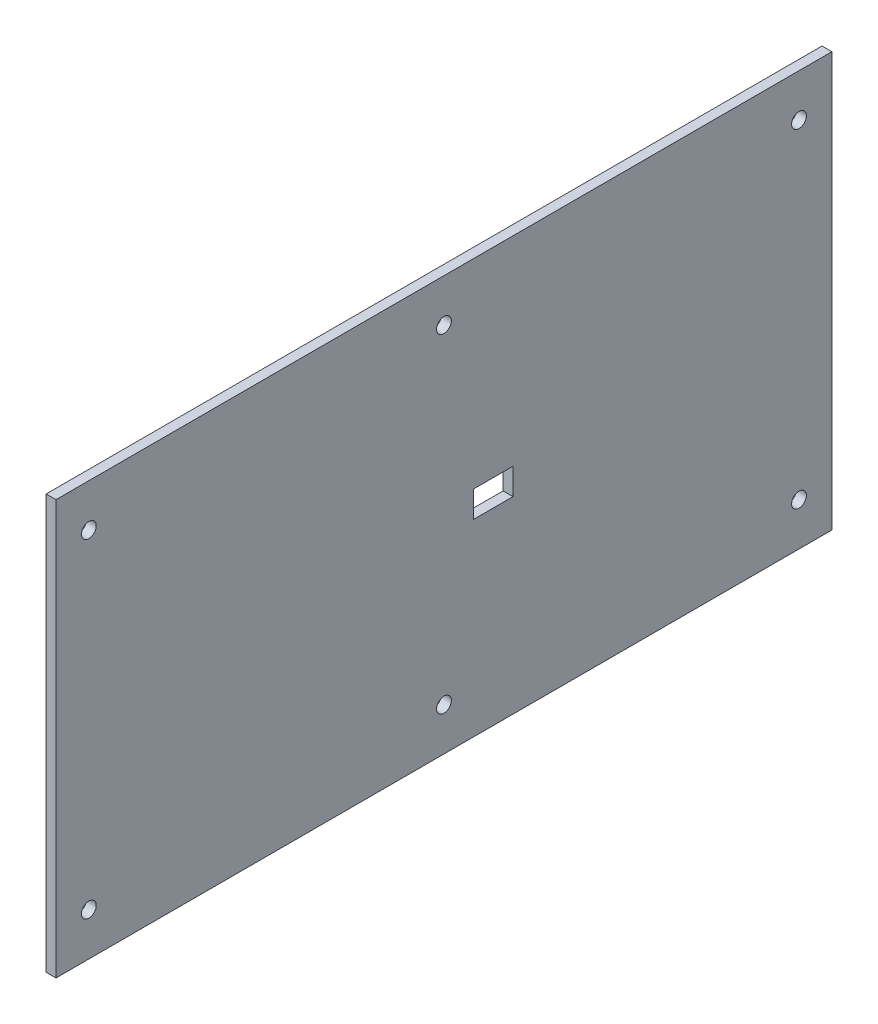
ISO-10303-21;
HEADER;
FILE_DESCRIPTION(('STEP AP214'),'2;1');
FILE_NAME('part.step','',(''),(''),'','','');
FILE_SCHEMA(('AUTOMOTIVE_DESIGN { 1 0 10303 214 1 1 1 1 }'));
ENDSEC;
DATA;
#1=APPLICATION_CONTEXT('core data for automotive mechanical design processes');
#2=APPLICATION_PROTOCOL_DEFINITION('international standard','automotive_design',2000,#1);
#3=PRODUCT_CONTEXT('',#1,'mechanical');
#4=PRODUCT('Part','Part','',(#3));
#5=PRODUCT_RELATED_PRODUCT_CATEGORY('part','',(#4));
#6=PRODUCT_DEFINITION_FORMATION('','',#4);
#7=PRODUCT_DEFINITION_CONTEXT('part definition',#1,'design');
#8=PRODUCT_DEFINITION('design','',#6,#7);
#9=PRODUCT_DEFINITION_SHAPE('','',#8);
#10=(LENGTH_UNIT() NAMED_UNIT(*) SI_UNIT(.MILLI.,.METRE.));
#11=(NAMED_UNIT(*) PLANE_ANGLE_UNIT() SI_UNIT($,.RADIAN.));
#12=(NAMED_UNIT(*) SI_UNIT($,.STERADIAN.) SOLID_ANGLE_UNIT());
#13=UNCERTAINTY_MEASURE_WITH_UNIT(LENGTH_MEASURE(1.E-05),#10,'distance_accuracy_value','');
#14=(GEOMETRIC_REPRESENTATION_CONTEXT(3) GLOBAL_UNCERTAINTY_ASSIGNED_CONTEXT((#13)) GLOBAL_UNIT_ASSIGNED_CONTEXT((#10,
#11,#12)) REPRESENTATION_CONTEXT('',''));
#15=CARTESIAN_POINT('',(0.,0.,0.));
#16=DIRECTION('',(0.,0.,1.));
#17=DIRECTION('',(1.,0.,0.));
#18=AXIS2_PLACEMENT_3D('',#15,#16,#17);
#19=CARTESIAN_POINT('',(-243.,123.,-1.40831324274686E-13));
#20=DIRECTION('',(0.,0.,1.));
#21=DIRECTION('',(1.,0.,0.));
#22=AXIS2_PLACEMENT_3D('',#19,#20,#21);
#23=PLANE('',#22);
#24=DIRECTION('',(0.,-1.,0.));
#25=VECTOR('',#24,1.);
#26=CARTESIAN_POINT('',(-240.,123.,-1.42984142443529E-13));
#27=LINE('',#26,#25);
#28=CARTESIAN_POINT('',(-240.,123.,-1.42984142443529E-13));
#29=VERTEX_POINT('',#28);
#30=CARTESIAN_POINT('',(-240.,-3.,0.));
#31=VERTEX_POINT('',#30);
#32=EDGE_CURVE('E167',#29,#31,#27,.T.);
#33=ORIENTED_EDGE('',*,*,#32,.T.);
#34=DIRECTION('',(1.,0.,0.));
#35=VECTOR('',#34,1.);
#36=CARTESIAN_POINT('',(-243.,-2.99999999999999,0.));
#37=LINE('',#36,#35);
#38=CARTESIAN_POINT('',(-243.,-2.99999999999999,0.));
#39=VERTEX_POINT('',#38);
#40=EDGE_CURVE('E11',#39,#31,#37,.T.);
#41=ORIENTED_EDGE('',*,*,#40,.F.);
#42=DIRECTION('',(0.,-1.,0.));
#43=VECTOR('',#42,1.);
#44=CARTESIAN_POINT('',(-243.,123.,-1.40831324274686E-13));
#45=LINE('',#44,#43);
#46=CARTESIAN_POINT('',(-243.,123.,-1.40831324274686E-13));
#47=VERTEX_POINT('',#46);
#48=EDGE_CURVE('E170',#47,#39,#45,.T.);
#49=ORIENTED_EDGE('',*,*,#48,.F.);
#50=DIRECTION('',(1.,0.,0.));
#51=VECTOR('',#50,1.);
#52=CARTESIAN_POINT('',(-243.,123.,-1.40831324274686E-13));
#53=LINE('',#52,#51);
#54=EDGE_CURVE('E180',#47,#29,#53,.T.);
#55=ORIENTED_EDGE('',*,*,#54,.T.);
#56=EDGE_LOOP('',(#33,#41,#49,#55));
#57=FACE_BOUND('',#56,.T.);
#58=ADVANCED_FACE('F33',(#57),#23,.F.);
#59=CARTESIAN_POINT('',(-243.,-2.99999999999999,0.));
#60=DIRECTION('',(0.,1.,0.));
#61=DIRECTION('',(0.,0.,1.));
#62=AXIS2_PLACEMENT_3D('',#59,#60,#61);
#63=PLANE('',#62);
#64=DIRECTION('',(0.,0.,1.));
#65=VECTOR('',#64,1.);
#66=CARTESIAN_POINT('',(-240.,-3.,0.));
#67=LINE('',#66,#65);
#68=CARTESIAN_POINT('',(-240.,-2.99999999999922,236.));
#69=VERTEX_POINT('',#68);
#70=EDGE_CURVE('E183',#31,#69,#67,.T.);
#71=ORIENTED_EDGE('',*,*,#70,.T.);
#72=DIRECTION('',(1.,0.,0.));
#73=VECTOR('',#72,1.);
#74=CARTESIAN_POINT('',(-243.,-2.99999999999921,236.));
#75=LINE('',#74,#73);
#76=CARTESIAN_POINT('',(-243.,-2.99999999999921,236.));
#77=VERTEX_POINT('',#76);
#78=EDGE_CURVE('E40',#77,#69,#75,.T.);
#79=ORIENTED_EDGE('',*,*,#78,.F.);
#80=DIRECTION('',(0.,0.,1.));
#81=VECTOR('',#80,1.);
#82=CARTESIAN_POINT('',(-243.,-2.99999999999999,0.));
#83=LINE('',#82,#81);
#84=EDGE_CURVE('E173',#39,#77,#83,.T.);
#85=ORIENTED_EDGE('',*,*,#84,.F.);
#86=ORIENTED_EDGE('',*,*,#40,.T.);
#87=EDGE_LOOP('',(#71,#79,#85,#86));
#88=FACE_BOUND('',#87,.T.);
#89=ADVANCED_FACE('F212',(#88),#63,.F.);
#90=CARTESIAN_POINT('',(-243.,123.,236.));
#91=DIRECTION('',(0.,0.,-1.));
#92=DIRECTION('',(0.,1.,0.));
#93=AXIS2_PLACEMENT_3D('',#90,#91,#92);
#94=PLANE('',#93);
#95=DIRECTION('',(0.,1.,0.));
#96=VECTOR('',#95,1.);
#97=CARTESIAN_POINT('',(-240.,123.,236.));
#98=LINE('',#97,#96);
#99=CARTESIAN_POINT('',(-240.,123.,236.));
#100=VERTEX_POINT('',#99);
#101=EDGE_CURVE('E185',#69,#100,#98,.T.);
#102=ORIENTED_EDGE('',*,*,#101,.T.);
#103=DIRECTION('',(1.,0.,0.));
#104=VECTOR('',#103,1.);
#105=CARTESIAN_POINT('',(-243.,123.,236.));
#106=LINE('',#105,#104);
#107=CARTESIAN_POINT('',(-243.,123.,236.));
#108=VERTEX_POINT('',#107);
#109=EDGE_CURVE('E190',#108,#100,#106,.T.);
#110=ORIENTED_EDGE('',*,*,#109,.F.);
#111=DIRECTION('',(0.,1.,0.));
#112=VECTOR('',#111,1.);
#113=CARTESIAN_POINT('',(-243.,123.,236.));
#114=LINE('',#113,#112);
#115=EDGE_CURVE('E176',#77,#108,#114,.T.);
#116=ORIENTED_EDGE('',*,*,#115,.F.);
#117=ORIENTED_EDGE('',*,*,#78,.T.);
#118=EDGE_LOOP('',(#102,#110,#116,#117));
#119=FACE_BOUND('',#118,.T.);
#120=ADVANCED_FACE('F197',(#119),#94,.F.);
#121=CARTESIAN_POINT('',(-243.,123.,-1.40831324274686E-13));
#122=DIRECTION('',(0.,-1.,0.));
#123=DIRECTION('',(1.,0.,0.));
#124=AXIS2_PLACEMENT_3D('',#121,#122,#123);
#125=PLANE('',#124);
#126=DIRECTION('',(0.,0.,-1.));
#127=VECTOR('',#126,1.);
#128=CARTESIAN_POINT('',(-240.,123.,-1.42984142443529E-13));
#129=LINE('',#128,#127);
#130=EDGE_CURVE('E174',#100,#29,#129,.T.);
#131=ORIENTED_EDGE('',*,*,#130,.T.);
#132=ORIENTED_EDGE('',*,*,#54,.F.);
#133=DIRECTION('',(0.,0.,-1.));
#134=VECTOR('',#133,1.);
#135=CARTESIAN_POINT('',(-243.,123.,-1.40831324274686E-13));
#136=LINE('',#135,#134);
#137=EDGE_CURVE('E178',#108,#47,#136,.T.);
#138=ORIENTED_EDGE('',*,*,#137,.F.);
#139=ORIENTED_EDGE('',*,*,#109,.T.);
#140=EDGE_LOOP('',(#131,#132,#138,#139));
#141=FACE_BOUND('',#140,.T.);
#142=ADVANCED_FACE('F206',(#141),#125,.F.);
#143=CARTESIAN_POINT('',(-243.,7.49944768594837E-13,1.71508872772678E-13));
#144=DIRECTION('',(-1.,0.,0.));
#145=DIRECTION('',(0.,-1.,0.));
#146=AXIS2_PLACEMENT_3D('',#143,#144,#145);
#147=PLANE('',#146);
#148=DIRECTION('',(0.,0.,1.));
#149=VECTOR('',#148,1.);
#150=CARTESIAN_POINT('',(-243.,62.3,109.));
#151=LINE('',#150,#149);
#152=CARTESIAN_POINT('',(-243.,62.3,97.));
#153=VERTEX_POINT('',#152);
#154=CARTESIAN_POINT('',(-243.,62.3,109.));
#155=VERTEX_POINT('',#154);
#156=EDGE_CURVE('E99',#153,#155,#151,.T.);
#157=ORIENTED_EDGE('',*,*,#156,.T.);
#158=DIRECTION('',(0.,-1.,0.));
#159=VECTOR('',#158,1.);
#160=CARTESIAN_POINT('',(-243.,62.3,109.));
#161=LINE('',#160,#159);
#162=CARTESIAN_POINT('',(-243.,54.3,109.));
#163=VERTEX_POINT('',#162);
#164=EDGE_CURVE('E108',#155,#163,#161,.T.);
#165=ORIENTED_EDGE('',*,*,#164,.T.);
#166=DIRECTION('',(0.,0.,-1.));
#167=VECTOR('',#166,1.);
#168=CARTESIAN_POINT('',(-243.,54.3,109.));
#169=LINE('',#168,#167);
#170=CARTESIAN_POINT('',(-243.,54.3,97.));
#171=VERTEX_POINT('',#170);
#172=EDGE_CURVE('E47',#163,#171,#169,.T.);
#173=ORIENTED_EDGE('',*,*,#172,.T.);
#174=DIRECTION('',(0.,1.,0.));
#175=VECTOR('',#174,1.);
#176=CARTESIAN_POINT('',(-243.,62.3,97.));
#177=LINE('',#176,#175);
#178=EDGE_CURVE('E105',#171,#153,#177,.T.);
#179=ORIENTED_EDGE('',*,*,#178,.T.);
#180=EDGE_LOOP('',(#157,#165,#173,#179));
#181=FACE_BOUND('',#180,.T.);
#182=CARTESIAN_POINT('',(-243.,10.000000000002,9.99999999999998));
#183=DIRECTION('',(-1.,0.,0.));
#184=DIRECTION('',(0.,-1.,0.));
#185=AXIS2_PLACEMENT_3D('',#182,#183,#184);
#186=CIRCLE('',#185,2.25000000000004);
#187=CARTESIAN_POINT('',(-243.,7.75000000000196,9.99999999999998));
#188=VERTEX_POINT('',#187);
#189=EDGE_CURVE('E130',#188,#188,#186,.T.);
#190=ORIENTED_EDGE('',*,*,#189,.F.);
#191=EDGE_LOOP('',(#190));
#192=FACE_BOUND('',#191,.T.);
#193=CARTESIAN_POINT('',(-243.,10.0000000000016,118.));
#194=DIRECTION('',(-1.,0.,0.));
#195=DIRECTION('',(0.,-1.,0.));
#196=AXIS2_PLACEMENT_3D('',#193,#194,#195);
#197=CIRCLE('',#196,2.25000000000004);
#198=CARTESIAN_POINT('',(-243.,7.75000000000161,118.));
#199=VERTEX_POINT('',#198);
#200=EDGE_CURVE('E137',#199,#199,#197,.T.);
#201=ORIENTED_EDGE('',*,*,#200,.F.);
#202=EDGE_LOOP('',(#201));
#203=FACE_BOUND('',#202,.T.);
#204=CARTESIAN_POINT('',(-243.,10.0000000000016,226.));
#205=DIRECTION('',(-1.,0.,0.));
#206=DIRECTION('',(0.,-1.,0.));
#207=AXIS2_PLACEMENT_3D('',#204,#205,#206);
#208=CIRCLE('',#207,2.25000000000006);
#209=CARTESIAN_POINT('',(-243.,7.75000000000156,226.));
#210=VERTEX_POINT('',#209);
#211=EDGE_CURVE('E143',#210,#210,#208,.T.);
#212=ORIENTED_EDGE('',*,*,#211,.F.);
#213=EDGE_LOOP('',(#212));
#214=FACE_BOUND('',#213,.T.);
#215=CARTESIAN_POINT('',(-243.,110.000000000001,9.99999999999997));
#216=DIRECTION('',(-1.,0.,0.));
#217=DIRECTION('',(0.,-1.,0.));
#218=AXIS2_PLACEMENT_3D('',#215,#216,#217);
#219=CIRCLE('',#218,2.25000000000001);
#220=CARTESIAN_POINT('',(-243.,107.750000000001,9.99999999999997));
#221=VERTEX_POINT('',#220);
#222=EDGE_CURVE('E149',#221,#221,#219,.T.);
#223=ORIENTED_EDGE('',*,*,#222,.F.);
#224=EDGE_LOOP('',(#223));
#225=FACE_BOUND('',#224,.T.);
#226=CARTESIAN_POINT('',(-243.,110.000000000001,118.));
#227=DIRECTION('',(-1.,0.,0.));
#228=DIRECTION('',(0.,-1.,0.));
#229=AXIS2_PLACEMENT_3D('',#226,#227,#228);
#230=CIRCLE('',#229,2.25000000000005);
#231=CARTESIAN_POINT('',(-243.,107.750000000001,118.));
#232=VERTEX_POINT('',#231);
#233=EDGE_CURVE('E155',#232,#232,#230,.T.);
#234=ORIENTED_EDGE('',*,*,#233,.F.);
#235=EDGE_LOOP('',(#234));
#236=FACE_BOUND('',#235,.T.);
#237=CARTESIAN_POINT('',(-243.,110.000000000001,226.));
#238=DIRECTION('',(-1.,0.,0.));
#239=DIRECTION('',(0.,-1.,0.));
#240=AXIS2_PLACEMENT_3D('',#237,#238,#239);
#241=CIRCLE('',#240,2.2500000000001);
#242=CARTESIAN_POINT('',(-243.,107.750000000001,226.));
#243=VERTEX_POINT('',#242);
#244=EDGE_CURVE('E161',#243,#243,#241,.T.);
#245=ORIENTED_EDGE('',*,*,#244,.F.);
#246=EDGE_LOOP('',(#245));
#247=FACE_BOUND('',#246,.T.);
#248=ORIENTED_EDGE('',*,*,#48,.T.);
#249=ORIENTED_EDGE('',*,*,#84,.T.);
#250=ORIENTED_EDGE('',*,*,#115,.T.);
#251=ORIENTED_EDGE('',*,*,#137,.T.);
#252=EDGE_LOOP('',(#248,#249,#250,#251));
#253=FACE_BOUND('',#252,.T.);
#254=ADVANCED_FACE('F112',(#181,#192,#203,#214,#225,#236,#247,#253),#147,.T.);
#255=CARTESIAN_POINT('',(-240.,7.40148683083438E-13,1.69356054603835E-13));
#256=DIRECTION('',(-1.,0.,0.));
#257=DIRECTION('',(0.,-1.,0.));
#258=AXIS2_PLACEMENT_3D('',#255,#256,#257);
#259=PLANE('',#258);
#260=DIRECTION('',(0.,-1.,0.));
#261=VECTOR('',#260,1.);
#262=CARTESIAN_POINT('',(-240.,62.3,109.));
#263=LINE('',#262,#261);
#264=CARTESIAN_POINT('',(-240.,62.3,109.));
#265=VERTEX_POINT('',#264);
#266=CARTESIAN_POINT('',(-240.,54.3,109.));
#267=VERTEX_POINT('',#266);
#268=EDGE_CURVE('E124',#265,#267,#263,.T.);
#269=ORIENTED_EDGE('',*,*,#268,.F.);
#270=DIRECTION('',(0.,0.,1.));
#271=VECTOR('',#270,1.);
#272=CARTESIAN_POINT('',(-240.,62.3,109.));
#273=LINE('',#272,#271);
#274=CARTESIAN_POINT('',(-240.,62.3,97.));
#275=VERTEX_POINT('',#274);
#276=EDGE_CURVE('E55',#275,#265,#273,.T.);
#277=ORIENTED_EDGE('',*,*,#276,.F.);
#278=DIRECTION('',(0.,1.,0.));
#279=VECTOR('',#278,1.);
#280=CARTESIAN_POINT('',(-240.,62.3,97.));
#281=LINE('',#280,#279);
#282=CARTESIAN_POINT('',(-240.,54.3,97.));
#283=VERTEX_POINT('',#282);
#284=EDGE_CURVE('E115',#283,#275,#281,.T.);
#285=ORIENTED_EDGE('',*,*,#284,.F.);
#286=DIRECTION('',(0.,0.,-1.));
#287=VECTOR('',#286,1.);
#288=CARTESIAN_POINT('',(-240.,54.3,109.));
#289=LINE('',#288,#287);
#290=EDGE_CURVE('E118',#267,#283,#289,.T.);
#291=ORIENTED_EDGE('',*,*,#290,.F.);
#292=EDGE_LOOP('',(#269,#277,#285,#291));
#293=FACE_BOUND('',#292,.T.);
#294=CARTESIAN_POINT('',(-240.,10.000000000002,9.99999999999998));
#295=DIRECTION('',(-1.,0.,0.));
#296=DIRECTION('',(0.,-1.,0.));
#297=AXIS2_PLACEMENT_3D('',#294,#295,#296);
#298=CIRCLE('',#297,2.25000000000004);
#299=CARTESIAN_POINT('',(-240.,7.75000000000195,9.99999999999998));
#300=VERTEX_POINT('',#299);
#301=EDGE_CURVE('E134',#300,#300,#298,.T.);
#302=ORIENTED_EDGE('',*,*,#301,.T.);
#303=EDGE_LOOP('',(#302));
#304=FACE_BOUND('',#303,.T.);
#305=CARTESIAN_POINT('',(-239.999999999999,10.0000000000016,118.));
#306=DIRECTION('',(-1.,0.,0.));
#307=DIRECTION('',(0.,-1.,0.));
#308=AXIS2_PLACEMENT_3D('',#305,#306,#307);
#309=CIRCLE('',#308,2.25000000000004);
#310=CARTESIAN_POINT('',(-239.999999999999,7.7500000000016,118.));
#311=VERTEX_POINT('',#310);
#312=EDGE_CURVE('E140',#311,#311,#309,.T.);
#313=ORIENTED_EDGE('',*,*,#312,.T.);
#314=EDGE_LOOP('',(#313));
#315=FACE_BOUND('',#314,.T.);
#316=CARTESIAN_POINT('',(-239.999999999999,10.0000000000016,226.));
#317=DIRECTION('',(-1.,0.,0.));
#318=DIRECTION('',(0.,-1.,0.));
#319=AXIS2_PLACEMENT_3D('',#316,#317,#318);
#320=CIRCLE('',#319,2.25000000000006);
#321=CARTESIAN_POINT('',(-239.999999999999,7.75000000000155,226.));
#322=VERTEX_POINT('',#321);
#323=EDGE_CURVE('E146',#322,#322,#320,.T.);
#324=ORIENTED_EDGE('',*,*,#323,.T.);
#325=EDGE_LOOP('',(#324));
#326=FACE_BOUND('',#325,.T.);
#327=CARTESIAN_POINT('',(-239.999999999999,110.000000000001,9.99999999999997));
#328=DIRECTION('',(-1.,0.,0.));
#329=DIRECTION('',(0.,-1.,0.));
#330=AXIS2_PLACEMENT_3D('',#327,#328,#329);
#331=CIRCLE('',#330,2.25000000000001);
#332=CARTESIAN_POINT('',(-239.999999999999,107.750000000001,9.99999999999997));
#333=VERTEX_POINT('',#332);
#334=EDGE_CURVE('E152',#333,#333,#331,.T.);
#335=ORIENTED_EDGE('',*,*,#334,.T.);
#336=EDGE_LOOP('',(#335));
#337=FACE_BOUND('',#336,.T.);
#338=CARTESIAN_POINT('',(-239.999999999999,110.000000000001,118.));
#339=DIRECTION('',(-1.,0.,0.));
#340=DIRECTION('',(0.,-1.,0.));
#341=AXIS2_PLACEMENT_3D('',#338,#339,#340);
#342=CIRCLE('',#341,2.25000000000005);
#343=CARTESIAN_POINT('',(-239.999999999999,107.750000000001,118.));
#344=VERTEX_POINT('',#343);
#345=EDGE_CURVE('E158',#344,#344,#342,.T.);
#346=ORIENTED_EDGE('',*,*,#345,.T.);
#347=EDGE_LOOP('',(#346));
#348=FACE_BOUND('',#347,.T.);
#349=CARTESIAN_POINT('',(-239.999999999999,110.000000000001,226.));
#350=DIRECTION('',(-1.,0.,0.));
#351=DIRECTION('',(0.,-1.,0.));
#352=AXIS2_PLACEMENT_3D('',#349,#350,#351);
#353=CIRCLE('',#352,2.2500000000001);
#354=CARTESIAN_POINT('',(-239.999999999999,107.750000000001,226.));
#355=VERTEX_POINT('',#354);
#356=EDGE_CURVE('E164',#355,#355,#353,.T.);
#357=ORIENTED_EDGE('',*,*,#356,.T.);
#358=EDGE_LOOP('',(#357));
#359=FACE_BOUND('',#358,.T.);
#360=ORIENTED_EDGE('',*,*,#32,.F.);
#361=ORIENTED_EDGE('',*,*,#130,.F.);
#362=ORIENTED_EDGE('',*,*,#101,.F.);
#363=ORIENTED_EDGE('',*,*,#70,.F.);
#364=EDGE_LOOP('',(#360,#361,#362,#363));
#365=FACE_BOUND('',#364,.T.);
#366=ADVANCED_FACE('F203',(#293,#304,#315,#326,#337,#348,#359,#365),#259,.F.);
#367=CARTESIAN_POINT('',(-239.999999999999,110.000000000001,226.));
#368=DIRECTION('',(-1.,0.,0.));
#369=DIRECTION('',(0.,-1.,0.));
#370=AXIS2_PLACEMENT_3D('',#367,#368,#369);
#371=CYLINDRICAL_SURFACE('',#370,2.2500000000001);
#372=ORIENTED_EDGE('',*,*,#356,.F.);
#373=EDGE_LOOP('',(#372));
#374=FACE_BOUND('',#373,.T.);
#375=ORIENTED_EDGE('',*,*,#244,.T.);
#376=EDGE_LOOP('',(#375));
#377=FACE_BOUND('',#376,.T.);
#378=ADVANCED_FACE('F224',(#374,#377),#371,.F.);
#379=CARTESIAN_POINT('',(-239.999999999999,110.000000000001,118.));
#380=DIRECTION('',(-1.,0.,0.));
#381=DIRECTION('',(0.,-1.,0.));
#382=AXIS2_PLACEMENT_3D('',#379,#380,#381);
#383=CYLINDRICAL_SURFACE('',#382,2.25000000000005);
#384=ORIENTED_EDGE('',*,*,#345,.F.);
#385=EDGE_LOOP('',(#384));
#386=FACE_BOUND('',#385,.T.);
#387=ORIENTED_EDGE('',*,*,#233,.T.);
#388=EDGE_LOOP('',(#387));
#389=FACE_BOUND('',#388,.T.);
#390=ADVANCED_FACE('F230',(#386,#389),#383,.F.);
#391=CARTESIAN_POINT('',(-239.999999999999,110.000000000001,9.99999999999997));
#392=DIRECTION('',(-1.,0.,0.));
#393=DIRECTION('',(0.,-1.,0.));
#394=AXIS2_PLACEMENT_3D('',#391,#392,#393);
#395=CYLINDRICAL_SURFACE('',#394,2.25000000000001);
#396=ORIENTED_EDGE('',*,*,#334,.F.);
#397=EDGE_LOOP('',(#396));
#398=FACE_BOUND('',#397,.T.);
#399=ORIENTED_EDGE('',*,*,#222,.T.);
#400=EDGE_LOOP('',(#399));
#401=FACE_BOUND('',#400,.T.);
#402=ADVANCED_FACE('F234',(#398,#401),#395,.F.);
#403=CARTESIAN_POINT('',(-239.999999999999,10.0000000000016,226.));
#404=DIRECTION('',(-1.,0.,0.));
#405=DIRECTION('',(0.,-1.,0.));
#406=AXIS2_PLACEMENT_3D('',#403,#404,#405);
#407=CYLINDRICAL_SURFACE('',#406,2.25000000000006);
#408=ORIENTED_EDGE('',*,*,#323,.F.);
#409=EDGE_LOOP('',(#408));
#410=FACE_BOUND('',#409,.T.);
#411=ORIENTED_EDGE('',*,*,#211,.T.);
#412=EDGE_LOOP('',(#411));
#413=FACE_BOUND('',#412,.T.);
#414=ADVANCED_FACE('F238',(#410,#413),#407,.F.);
#415=CARTESIAN_POINT('',(-239.999999999999,10.0000000000016,118.));
#416=DIRECTION('',(-1.,0.,0.));
#417=DIRECTION('',(0.,-1.,0.));
#418=AXIS2_PLACEMENT_3D('',#415,#416,#417);
#419=CYLINDRICAL_SURFACE('',#418,2.25000000000004);
#420=ORIENTED_EDGE('',*,*,#312,.F.);
#421=EDGE_LOOP('',(#420));
#422=FACE_BOUND('',#421,.T.);
#423=ORIENTED_EDGE('',*,*,#200,.T.);
#424=EDGE_LOOP('',(#423));
#425=FACE_BOUND('',#424,.T.);
#426=ADVANCED_FACE('F242',(#422,#425),#419,.F.);
#427=CARTESIAN_POINT('',(-240.,10.000000000002,9.99999999999998));
#428=DIRECTION('',(-1.,0.,0.));
#429=DIRECTION('',(0.,-1.,0.));
#430=AXIS2_PLACEMENT_3D('',#427,#428,#429);
#431=CYLINDRICAL_SURFACE('',#430,2.25000000000004);
#432=ORIENTED_EDGE('',*,*,#301,.F.);
#433=EDGE_LOOP('',(#432));
#434=FACE_BOUND('',#433,.T.);
#435=ORIENTED_EDGE('',*,*,#189,.T.);
#436=EDGE_LOOP('',(#435));
#437=FACE_BOUND('',#436,.T.);
#438=ADVANCED_FACE('F246',(#434,#437),#431,.F.);
#439=CARTESIAN_POINT('',(-243.,62.3,109.));
#440=DIRECTION('',(0.,1.,0.));
#441=DIRECTION('',(-1.,0.,0.));
#442=AXIS2_PLACEMENT_3D('',#439,#440,#441);
#443=PLANE('',#442);
#444=ORIENTED_EDGE('',*,*,#276,.T.);
#445=DIRECTION('',(1.,0.,0.));
#446=VECTOR('',#445,1.);
#447=CARTESIAN_POINT('',(-243.,62.3,109.));
#448=LINE('',#447,#446);
#449=EDGE_CURVE('E95',#155,#265,#448,.T.);
#450=ORIENTED_EDGE('',*,*,#449,.F.);
#451=ORIENTED_EDGE('',*,*,#156,.F.);
#452=DIRECTION('',(1.,0.,0.));
#453=VECTOR('',#452,1.);
#454=CARTESIAN_POINT('',(-243.,62.3,97.));
#455=LINE('',#454,#453);
#456=EDGE_CURVE('E128',#153,#275,#455,.T.);
#457=ORIENTED_EDGE('',*,*,#456,.T.);
#458=EDGE_LOOP('',(#444,#450,#451,#457));
#459=FACE_BOUND('',#458,.T.);
#460=ADVANCED_FACE('F97',(#459),#443,.F.);
#461=CARTESIAN_POINT('',(-243.,62.3,97.));
#462=DIRECTION('',(0.,0.,-1.));
#463=DIRECTION('',(-1.,0.,0.));
#464=AXIS2_PLACEMENT_3D('',#461,#462,#463);
#465=PLANE('',#464);
#466=ORIENTED_EDGE('',*,*,#284,.T.);
#467=ORIENTED_EDGE('',*,*,#456,.F.);
#468=ORIENTED_EDGE('',*,*,#178,.F.);
#469=DIRECTION('',(1.,0.,0.));
#470=VECTOR('',#469,1.);
#471=CARTESIAN_POINT('',(-243.,54.3,97.));
#472=LINE('',#471,#470);
#473=EDGE_CURVE('E131',#171,#283,#472,.T.);
#474=ORIENTED_EDGE('',*,*,#473,.T.);
#475=EDGE_LOOP('',(#466,#467,#468,#474));
#476=FACE_BOUND('',#475,.T.);
#477=ADVANCED_FACE('F253',(#476),#465,.F.);
#478=CARTESIAN_POINT('',(-243.,54.3,109.));
#479=DIRECTION('',(0.,-1.,0.));
#480=DIRECTION('',(1.,0.,0.));
#481=AXIS2_PLACEMENT_3D('',#478,#479,#480);
#482=PLANE('',#481);
#483=ORIENTED_EDGE('',*,*,#290,.T.);
#484=ORIENTED_EDGE('',*,*,#473,.F.);
#485=ORIENTED_EDGE('',*,*,#172,.F.);
#486=DIRECTION('',(1.,0.,0.));
#487=VECTOR('',#486,1.);
#488=CARTESIAN_POINT('',(-243.,54.3,109.));
#489=LINE('',#488,#487);
#490=EDGE_CURVE('E104',#163,#267,#489,.T.);
#491=ORIENTED_EDGE('',*,*,#490,.T.);
#492=EDGE_LOOP('',(#483,#484,#485,#491));
#493=FACE_BOUND('',#492,.T.);
#494=ADVANCED_FACE('F256',(#493),#482,.F.);
#495=CARTESIAN_POINT('',(-243.,62.3,109.));
#496=DIRECTION('',(0.,0.,1.));
#497=DIRECTION('',(1.,0.,0.));
#498=AXIS2_PLACEMENT_3D('',#495,#496,#497);
#499=PLANE('',#498);
#500=ORIENTED_EDGE('',*,*,#268,.T.);
#501=ORIENTED_EDGE('',*,*,#490,.F.);
#502=ORIENTED_EDGE('',*,*,#164,.F.);
#503=ORIENTED_EDGE('',*,*,#449,.T.);
#504=EDGE_LOOP('',(#500,#501,#502,#503));
#505=FACE_BOUND('',#504,.T.);
#506=ADVANCED_FACE('F109',(#505),#499,.F.);
#507=CLOSED_SHELL('',(#58,#89,#120,#142,#254,#366,#378,#390,#402,#414,#426,#438,#460,#477,#494,#506));
#508=MANIFOLD_SOLID_BREP('B2',#507);
#509=ADVANCED_BREP_SHAPE_REPRESENTATION('',(#18,#508),#14);
#510=SHAPE_DEFINITION_REPRESENTATION(#9,#509);
ENDSEC;
END-ISO-10303-21;
